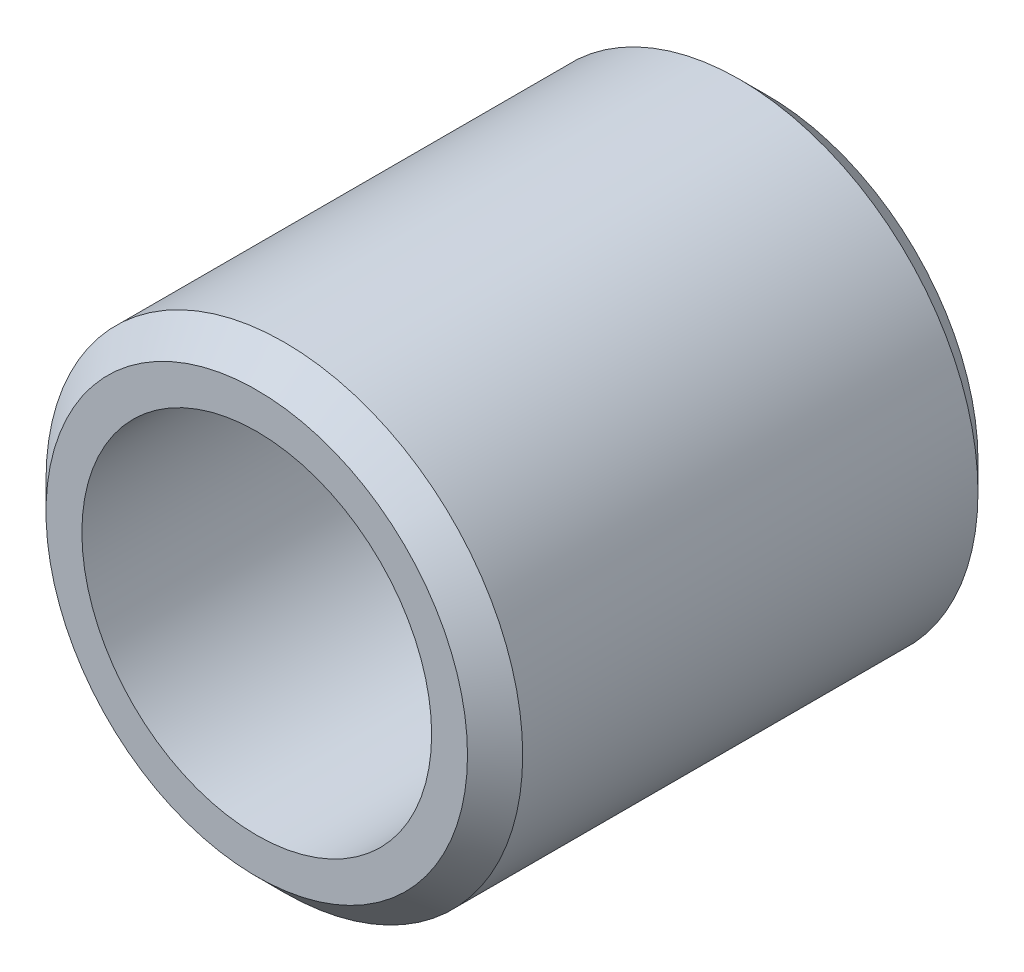
ISO-10303-21;
HEADER;
FILE_DESCRIPTION(('STEP AP214'),'2;1');
FILE_NAME('part.step','',(''),(''),'','','');
FILE_SCHEMA(('AUTOMOTIVE_DESIGN { 1 0 10303 214 1 1 1 1 }'));
ENDSEC;
DATA;
#1=APPLICATION_CONTEXT('core data for automotive mechanical design processes');
#2=APPLICATION_PROTOCOL_DEFINITION('international standard','automotive_design',2000,#1);
#3=PRODUCT_CONTEXT('',#1,'mechanical');
#4=PRODUCT('Part','Part','',(#3));
#5=PRODUCT_RELATED_PRODUCT_CATEGORY('part','',(#4));
#6=PRODUCT_DEFINITION_FORMATION('','',#4);
#7=PRODUCT_DEFINITION_CONTEXT('part definition',#1,'design');
#8=PRODUCT_DEFINITION('design','',#6,#7);
#9=PRODUCT_DEFINITION_SHAPE('','',#8);
#10=(LENGTH_UNIT() NAMED_UNIT(*) SI_UNIT(.MILLI.,.METRE.));
#11=(NAMED_UNIT(*) PLANE_ANGLE_UNIT() SI_UNIT($,.RADIAN.));
#12=(NAMED_UNIT(*) SI_UNIT($,.STERADIAN.) SOLID_ANGLE_UNIT());
#13=UNCERTAINTY_MEASURE_WITH_UNIT(LENGTH_MEASURE(1.E-05),#10,'distance_accuracy_value','');
#14=(GEOMETRIC_REPRESENTATION_CONTEXT(3) GLOBAL_UNCERTAINTY_ASSIGNED_CONTEXT((#13)) GLOBAL_UNIT_ASSIGNED_CONTEXT((#10,
#11,#12)) REPRESENTATION_CONTEXT('',''));
#15=CARTESIAN_POINT('',(0.,0.,0.));
#16=DIRECTION('',(0.,0.,1.));
#17=DIRECTION('',(1.,0.,0.));
#18=AXIS2_PLACEMENT_3D('',#15,#16,#17);
#19=CARTESIAN_POINT('',(0.,0.,4.191));
#20=DIRECTION('',(0.,0.,-1.));
#21=DIRECTION('',(-1.,0.,0.));
#22=AXIS2_PLACEMENT_3D('',#19,#20,#21);
#23=CONICAL_SURFACE('',#22,4.38785,0.785398163397449);
#24=CARTESIAN_POINT('',(0.,0.,4.699));
#25=DIRECTION('',(0.,0.,1.));
#26=DIRECTION('',(1.,0.,0.));
#27=AXIS2_PLACEMENT_3D('',#24,#25,#26);
#28=CIRCLE('',#27,3.87985);
#29=CARTESIAN_POINT('',(3.87985,0.,4.699));
#30=VERTEX_POINT('',#29);
#31=EDGE_CURVE('E54',#30,#30,#28,.T.);
#32=ORIENTED_EDGE('',*,*,#31,.F.);
#33=EDGE_LOOP('',(#32));
#34=FACE_BOUND('',#33,.T.);
#35=CARTESIAN_POINT('',(0.,0.,4.191));
#36=DIRECTION('',(0.,0.,1.));
#37=DIRECTION('',(1.,0.,0.));
#38=AXIS2_PLACEMENT_3D('',#35,#36,#37);
#39=CIRCLE('',#38,4.38785);
#40=CARTESIAN_POINT('',(4.38785,0.,4.191));
#41=VERTEX_POINT('',#40);
#42=EDGE_CURVE('E10',#41,#41,#39,.T.);
#43=ORIENTED_EDGE('',*,*,#42,.T.);
#44=EDGE_LOOP('',(#43));
#45=FACE_BOUND('',#44,.T.);
#46=ADVANCED_FACE('F32',(#34,#45),#23,.T.);
#47=CARTESIAN_POINT('',(0.,0.,-4.699));
#48=DIRECTION('',(0.,0.,1.));
#49=DIRECTION('',(1.,0.,0.));
#50=AXIS2_PLACEMENT_3D('',#47,#48,#49);
#51=CYLINDRICAL_SURFACE('',#50,4.38785);
#52=ORIENTED_EDGE('',*,*,#42,.F.);
#53=EDGE_LOOP('',(#52));
#54=FACE_BOUND('',#53,.T.);
#55=CARTESIAN_POINT('',(0.,0.,-4.191));
#56=DIRECTION('',(0.,0.,1.));
#57=DIRECTION('',(1.,0.,0.));
#58=AXIS2_PLACEMENT_3D('',#55,#56,#57);
#59=CIRCLE('',#58,4.38785);
#60=CARTESIAN_POINT('',(4.38785,0.,-4.191));
#61=VERTEX_POINT('',#60);
#62=EDGE_CURVE('E38',#61,#61,#59,.T.);
#63=ORIENTED_EDGE('',*,*,#62,.T.);
#64=EDGE_LOOP('',(#63));
#65=FACE_BOUND('',#64,.T.);
#66=ADVANCED_FACE('F61',(#54,#65),#51,.T.);
#67=CARTESIAN_POINT('',(0.,0.,-4.699));
#68=DIRECTION('',(0.,0.,1.));
#69=DIRECTION('',(1.,0.,0.));
#70=AXIS2_PLACEMENT_3D('',#67,#68,#69);
#71=CONICAL_SURFACE('',#70,3.87985,0.785398163397449);
#72=ORIENTED_EDGE('',*,*,#62,.F.);
#73=EDGE_LOOP('',(#72));
#74=FACE_BOUND('',#73,.T.);
#75=CARTESIAN_POINT('',(0.,0.,-4.699));
#76=DIRECTION('',(0.,0.,1.));
#77=DIRECTION('',(1.,0.,0.));
#78=AXIS2_PLACEMENT_3D('',#75,#76,#77);
#79=CIRCLE('',#78,3.87985);
#80=CARTESIAN_POINT('',(3.87985,0.,-4.699));
#81=VERTEX_POINT('',#80);
#82=EDGE_CURVE('E42',#81,#81,#79,.T.);
#83=ORIENTED_EDGE('',*,*,#82,.T.);
#84=EDGE_LOOP('',(#83));
#85=FACE_BOUND('',#84,.T.);
#86=ADVANCED_FACE('F65',(#74,#85),#71,.T.);
#87=CARTESIAN_POINT('',(0.,3.21945,-4.699));
#88=DIRECTION('',(0.,0.,1.));
#89=DIRECTION('',(1.,0.,0.));
#90=AXIS2_PLACEMENT_3D('',#87,#88,#89);
#91=PLANE('',#90);
#92=ORIENTED_EDGE('',*,*,#82,.F.);
#93=EDGE_LOOP('',(#92));
#94=FACE_BOUND('',#93,.T.);
#95=CARTESIAN_POINT('',(0.,0.,-4.699));
#96=DIRECTION('',(0.,0.,1.));
#97=DIRECTION('',(1.,0.,0.));
#98=AXIS2_PLACEMENT_3D('',#95,#96,#97);
#99=CIRCLE('',#98,3.21945);
#100=CARTESIAN_POINT('',(3.21945,0.,-4.699));
#101=VERTEX_POINT('',#100);
#102=EDGE_CURVE('E46',#101,#101,#99,.T.);
#103=ORIENTED_EDGE('',*,*,#102,.T.);
#104=EDGE_LOOP('',(#103));
#105=FACE_BOUND('',#104,.T.);
#106=ADVANCED_FACE('F70',(#94,#105),#91,.F.);
#107=CARTESIAN_POINT('',(0.,0.,-4.699));
#108=DIRECTION('',(0.,0.,1.));
#109=DIRECTION('',(1.,0.,0.));
#110=AXIS2_PLACEMENT_3D('',#107,#108,#109);
#111=CYLINDRICAL_SURFACE('',#110,3.21945);
#112=ORIENTED_EDGE('',*,*,#102,.F.);
#113=EDGE_LOOP('',(#112));
#114=FACE_BOUND('',#113,.T.);
#115=CARTESIAN_POINT('',(0.,0.,4.699));
#116=DIRECTION('',(0.,0.,1.));
#117=DIRECTION('',(1.,0.,0.));
#118=AXIS2_PLACEMENT_3D('',#115,#116,#117);
#119=CIRCLE('',#118,3.21945);
#120=CARTESIAN_POINT('',(3.21945,0.,4.699));
#121=VERTEX_POINT('',#120);
#122=EDGE_CURVE('E51',#121,#121,#119,.T.);
#123=ORIENTED_EDGE('',*,*,#122,.T.);
#124=EDGE_LOOP('',(#123));
#125=FACE_BOUND('',#124,.T.);
#126=ADVANCED_FACE('F76',(#114,#125),#111,.F.);
#127=CARTESIAN_POINT('',(0.,3.87985,4.699));
#128=DIRECTION('',(0.,0.,-1.));
#129=DIRECTION('',(-1.,0.,0.));
#130=AXIS2_PLACEMENT_3D('',#127,#128,#129);
#131=PLANE('',#130);
#132=ORIENTED_EDGE('',*,*,#122,.F.);
#133=EDGE_LOOP('',(#132));
#134=FACE_BOUND('',#133,.T.);
#135=ORIENTED_EDGE('',*,*,#31,.T.);
#136=EDGE_LOOP('',(#135));
#137=FACE_BOUND('',#136,.T.);
#138=ADVANCED_FACE('F58',(#134,#137),#131,.F.);
#139=CLOSED_SHELL('',(#46,#66,#86,#106,#126,#138));
#140=MANIFOLD_SOLID_BREP('B2',#139);
#141=ADVANCED_BREP_SHAPE_REPRESENTATION('',(#18,#140),#14);
#142=SHAPE_DEFINITION_REPRESENTATION(#9,#141);
ENDSEC;
END-ISO-10303-21;
